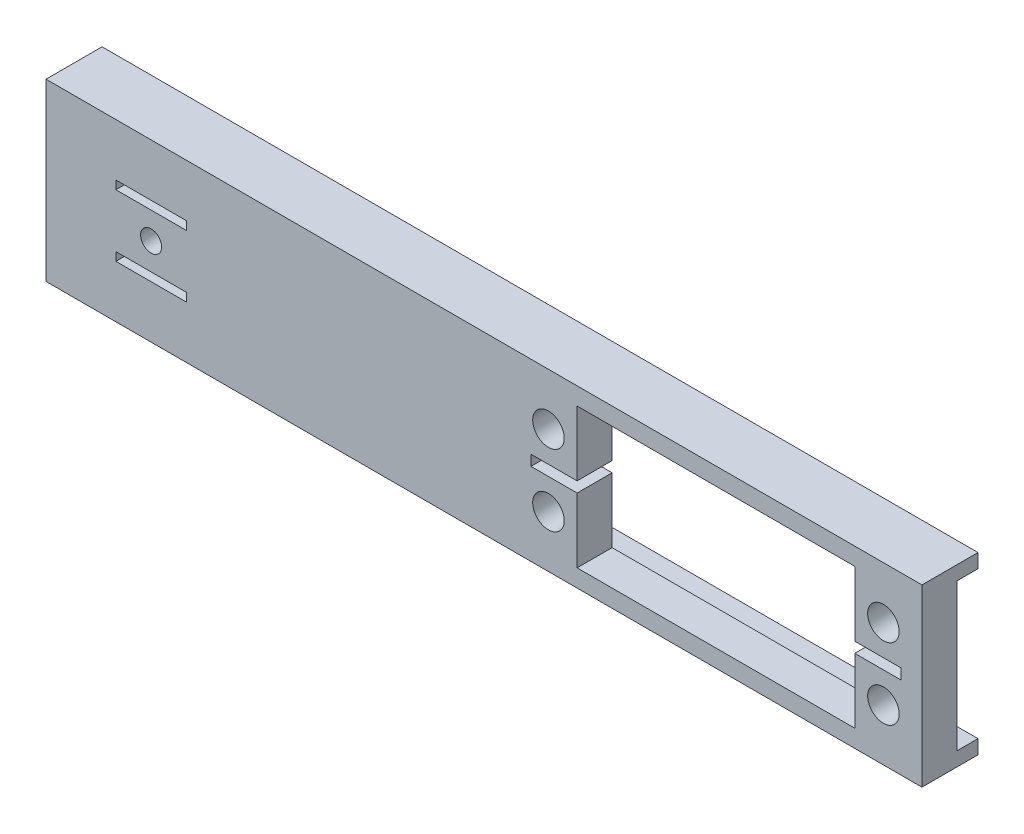
ISO-10303-21;
HEADER;
FILE_DESCRIPTION(('STEP AP214'),'2;1');
FILE_NAME('part.step','',(''),(''),'','','');
FILE_SCHEMA(('AUTOMOTIVE_DESIGN { 1 0 10303 214 1 1 1 1 }'));
ENDSEC;
DATA;
#1=APPLICATION_CONTEXT('core data for automotive mechanical design processes');
#2=APPLICATION_PROTOCOL_DEFINITION('international standard','automotive_design',2000,#1);
#3=PRODUCT_CONTEXT('',#1,'mechanical');
#4=PRODUCT('Part','Part','',(#3));
#5=PRODUCT_RELATED_PRODUCT_CATEGORY('part','',(#4));
#6=PRODUCT_DEFINITION_FORMATION('','',#4);
#7=PRODUCT_DEFINITION_CONTEXT('part definition',#1,'design');
#8=PRODUCT_DEFINITION('design','',#6,#7);
#9=PRODUCT_DEFINITION_SHAPE('','',#8);
#10=(LENGTH_UNIT() NAMED_UNIT(*) SI_UNIT(.MILLI.,.METRE.));
#11=(NAMED_UNIT(*) PLANE_ANGLE_UNIT() SI_UNIT($,.RADIAN.));
#12=(NAMED_UNIT(*) SI_UNIT($,.STERADIAN.) SOLID_ANGLE_UNIT());
#13=UNCERTAINTY_MEASURE_WITH_UNIT(LENGTH_MEASURE(1.E-05),#10,'distance_accuracy_value','');
#14=(GEOMETRIC_REPRESENTATION_CONTEXT(3) GLOBAL_UNCERTAINTY_ASSIGNED_CONTEXT((#13)) GLOBAL_UNIT_ASSIGNED_CONTEXT((#10,
#11,#12)) REPRESENTATION_CONTEXT('',''));
#15=CARTESIAN_POINT('',(0.,0.,0.));
#16=DIRECTION('',(0.,0.,1.));
#17=DIRECTION('',(1.,0.,0.));
#18=AXIS2_PLACEMENT_3D('',#15,#16,#17);
#19=CARTESIAN_POINT('',(0.,-5.0292,5.));
#20=DIRECTION('',(0.,-1.,0.));
#21=DIRECTION('',(1.,0.,0.));
#22=AXIS2_PLACEMENT_3D('',#19,#20,#21);
#23=PLANE('',#22);
#24=DIRECTION('',(-1.,0.,0.));
#25=VECTOR('',#24,1.);
#26=CARTESIAN_POINT('',(0.,-5.0292,0.));
#27=LINE('',#26,#25);
#28=CARTESIAN_POINT('',(-42.4708,-5.0292,0.));
#29=VERTEX_POINT('',#28);
#30=CARTESIAN_POINT('',(-52.5292,-5.0292,0.));
#31=VERTEX_POINT('',#30);
#32=EDGE_CURVE('E401',#29,#31,#27,.T.);
#33=ORIENTED_EDGE('',*,*,#32,.T.);
#34=DIRECTION('',(0.,0.,-1.));
#35=VECTOR('',#34,1.);
#36=CARTESIAN_POINT('',(-52.5292,-5.0292,5.));
#37=LINE('',#36,#35);
#38=CARTESIAN_POINT('',(-52.5292,-5.0292,5.));
#39=VERTEX_POINT('',#38);
#40=EDGE_CURVE('E429',#39,#31,#37,.T.);
#41=ORIENTED_EDGE('',*,*,#40,.F.);
#42=DIRECTION('',(-1.,0.,0.));
#43=VECTOR('',#42,1.);
#44=CARTESIAN_POINT('',(0.,-5.0292,5.));
#45=LINE('',#44,#43);
#46=CARTESIAN_POINT('',(-42.4708,-5.0292,5.));
#47=VERTEX_POINT('',#46);
#48=EDGE_CURVE('E329',#47,#39,#45,.T.);
#49=ORIENTED_EDGE('',*,*,#48,.F.);
#50=DIRECTION('',(0.,0.,-1.));
#51=VECTOR('',#50,1.);
#52=CARTESIAN_POINT('',(-42.4708,-5.0292,5.));
#53=LINE('',#52,#51);
#54=EDGE_CURVE('E421',#47,#29,#53,.T.);
#55=ORIENTED_EDGE('',*,*,#54,.T.);
#56=EDGE_LOOP('',(#33,#41,#49,#55));
#57=FACE_BOUND('',#56,.T.);
#58=ADVANCED_FACE('F45',(#57),#23,.F.);
#59=CARTESIAN_POINT('',(-52.5292,0.,5.));
#60=DIRECTION('',(-1.,0.,0.));
#61=DIRECTION('',(0.,0.,1.));
#62=AXIS2_PLACEMENT_3D('',#59,#60,#61);
#63=PLANE('',#62);
#64=DIRECTION('',(0.,1.,0.));
#65=VECTOR('',#64,1.);
#66=CARTESIAN_POINT('',(-52.5292,0.,0.));
#67=LINE('',#66,#65);
#68=CARTESIAN_POINT('',(-52.5292,-3.8227,0.));
#69=VERTEX_POINT('',#68);
#70=EDGE_CURVE('E356',#31,#69,#67,.T.);
#71=ORIENTED_EDGE('',*,*,#70,.T.);
#72=DIRECTION('',(0.,0.,-1.));
#73=VECTOR('',#72,1.);
#74=CARTESIAN_POINT('',(-52.5292,-3.8227,5.));
#75=LINE('',#74,#73);
#76=CARTESIAN_POINT('',(-52.5292,-3.8227,5.));
#77=VERTEX_POINT('',#76);
#78=EDGE_CURVE('E426',#77,#69,#75,.T.);
#79=ORIENTED_EDGE('',*,*,#78,.F.);
#80=DIRECTION('',(0.,1.,0.));
#81=VECTOR('',#80,1.);
#82=CARTESIAN_POINT('',(-52.5292,0.,5.));
#83=LINE('',#82,#81);
#84=EDGE_CURVE('E279',#39,#77,#83,.T.);
#85=ORIENTED_EDGE('',*,*,#84,.F.);
#86=ORIENTED_EDGE('',*,*,#40,.T.);
#87=EDGE_LOOP('',(#71,#79,#85,#86));
#88=FACE_BOUND('',#87,.T.);
#89=ADVANCED_FACE('F507',(#88),#63,.F.);
#90=CARTESIAN_POINT('',(0.,-3.8227,5.));
#91=DIRECTION('',(0.,1.,0.));
#92=DIRECTION('',(0.,0.,1.));
#93=AXIS2_PLACEMENT_3D('',#90,#91,#92);
#94=PLANE('',#93);
#95=DIRECTION('',(1.,0.,0.));
#96=VECTOR('',#95,1.);
#97=CARTESIAN_POINT('',(0.,-3.8227,0.));
#98=LINE('',#97,#96);
#99=CARTESIAN_POINT('',(-42.4708,-3.8227,0.));
#100=VERTEX_POINT('',#99);
#101=EDGE_CURVE('E404',#69,#100,#98,.T.);
#102=ORIENTED_EDGE('',*,*,#101,.T.);
#103=DIRECTION('',(0.,0.,-1.));
#104=VECTOR('',#103,1.);
#105=CARTESIAN_POINT('',(-42.4708,-3.8227,5.));
#106=LINE('',#105,#104);
#107=CARTESIAN_POINT('',(-42.4708,-3.8227,5.));
#108=VERTEX_POINT('',#107);
#109=EDGE_CURVE('E423',#108,#100,#106,.T.);
#110=ORIENTED_EDGE('',*,*,#109,.F.);
#111=DIRECTION('',(1.,0.,0.));
#112=VECTOR('',#111,1.);
#113=CARTESIAN_POINT('',(0.,-3.8227,5.));
#114=LINE('',#113,#112);
#115=EDGE_CURVE('E332',#77,#108,#114,.T.);
#116=ORIENTED_EDGE('',*,*,#115,.F.);
#117=ORIENTED_EDGE('',*,*,#78,.T.);
#118=EDGE_LOOP('',(#102,#110,#116,#117));
#119=FACE_BOUND('',#118,.T.);
#120=ADVANCED_FACE('F499',(#119),#94,.F.);
#121=CARTESIAN_POINT('',(0.,-12.5,5.));
#122=DIRECTION('',(0.,1.,0.));
#123=DIRECTION('',(0.,0.,1.));
#124=AXIS2_PLACEMENT_3D('',#121,#122,#123);
#125=PLANE('',#124);
#126=DIRECTION('',(0.,0.,-1.));
#127=VECTOR('',#126,1.);
#128=CARTESIAN_POINT('',(-62.5,-12.5,5.));
#129=LINE('',#128,#127);
#130=CARTESIAN_POINT('',(-62.5,-12.5,5.));
#131=VERTEX_POINT('',#130);
#132=CARTESIAN_POINT('',(-62.5,-12.5,-3.));
#133=VERTEX_POINT('',#132);
#134=EDGE_CURVE('E432',#131,#133,#129,.T.);
#135=ORIENTED_EDGE('',*,*,#134,.T.);
#136=DIRECTION('',(-1.,0.,0.));
#137=VECTOR('',#136,1.);
#138=CARTESIAN_POINT('',(0.,-12.5,-3.));
#139=LINE('',#138,#137);
#140=CARTESIAN_POINT('',(62.5,-12.5,-3.));
#141=VERTEX_POINT('',#140);
#142=EDGE_CURVE('E246',#141,#133,#139,.T.);
#143=ORIENTED_EDGE('',*,*,#142,.F.);
#144=DIRECTION('',(0.,0.,-1.));
#145=VECTOR('',#144,1.);
#146=CARTESIAN_POINT('',(62.5,-12.5,5.));
#147=LINE('',#146,#145);
#148=CARTESIAN_POINT('',(62.5,-12.5,5.));
#149=VERTEX_POINT('',#148);
#150=EDGE_CURVE('E424',#149,#141,#147,.T.);
#151=ORIENTED_EDGE('',*,*,#150,.F.);
#152=DIRECTION('',(1.,0.,0.));
#153=VECTOR('',#152,1.);
#154=CARTESIAN_POINT('',(0.,-12.5,5.));
#155=LINE('',#154,#153);
#156=EDGE_CURVE('E319',#131,#149,#155,.T.);
#157=ORIENTED_EDGE('',*,*,#156,.F.);
#158=EDGE_LOOP('',(#135,#143,#151,#157));
#159=FACE_BOUND('',#158,.T.);
#160=ADVANCED_FACE('F496',(#159),#125,.F.);
#161=CARTESIAN_POINT('',(62.5,0.,5.));
#162=DIRECTION('',(-1.,0.,0.));
#163=DIRECTION('',(0.,0.,1.));
#164=AXIS2_PLACEMENT_3D('',#161,#162,#163);
#165=PLANE('',#164);
#166=DIRECTION('',(0.,0.,-1.));
#167=VECTOR('',#166,1.);
#168=CARTESIAN_POINT('',(62.5,12.5,5.));
#169=LINE('',#168,#167);
#170=CARTESIAN_POINT('',(62.5,12.5,5.));
#171=VERTEX_POINT('',#170);
#172=CARTESIAN_POINT('',(62.5,12.5,-3.));
#173=VERTEX_POINT('',#172);
#174=EDGE_CURVE('E437',#171,#173,#169,.T.);
#175=ORIENTED_EDGE('',*,*,#174,.F.);
#176=DIRECTION('',(0.,1.,0.));
#177=VECTOR('',#176,1.);
#178=CARTESIAN_POINT('',(62.5,0.,5.));
#179=LINE('',#178,#177);
#180=EDGE_CURVE('E322',#149,#171,#179,.T.);
#181=ORIENTED_EDGE('',*,*,#180,.F.);
#182=ORIENTED_EDGE('',*,*,#150,.T.);
#183=DIRECTION('',(0.,-1.,0.));
#184=VECTOR('',#183,1.);
#185=CARTESIAN_POINT('',(62.5,-10.5,-3.));
#186=LINE('',#185,#184);
#187=CARTESIAN_POINT('',(62.5,-10.5,-3.));
#188=VERTEX_POINT('',#187);
#189=EDGE_CURVE('E251',#188,#141,#186,.T.);
#190=ORIENTED_EDGE('',*,*,#189,.F.);
#191=DIRECTION('',(0.,0.,-1.));
#192=VECTOR('',#191,1.);
#193=CARTESIAN_POINT('',(62.5,-10.5,5.));
#194=LINE('',#193,#192);
#195=CARTESIAN_POINT('',(62.5,-10.5,0.));
#196=VERTEX_POINT('',#195);
#197=EDGE_CURVE('E238',#196,#188,#194,.T.);
#198=ORIENTED_EDGE('',*,*,#197,.F.);
#199=DIRECTION('',(0.,1.,0.));
#200=VECTOR('',#199,1.);
#201=CARTESIAN_POINT('',(62.5,0.,0.));
#202=LINE('',#201,#200);
#203=CARTESIAN_POINT('',(62.5,10.5,0.));
#204=VERTEX_POINT('',#203);
#205=EDGE_CURVE('E60',#196,#204,#202,.T.);
#206=ORIENTED_EDGE('',*,*,#205,.T.);
#207=DIRECTION('',(0.,0.,-1.));
#208=VECTOR('',#207,1.);
#209=CARTESIAN_POINT('',(62.5,10.5,5.));
#210=LINE('',#209,#208);
#211=CARTESIAN_POINT('',(62.5,10.5,-3.));
#212=VERTEX_POINT('',#211);
#213=EDGE_CURVE('E260',#204,#212,#210,.T.);
#214=ORIENTED_EDGE('',*,*,#213,.T.);
#215=DIRECTION('',(0.,1.,0.));
#216=VECTOR('',#215,1.);
#217=CARTESIAN_POINT('',(62.5,10.5,-3.));
#218=LINE('',#217,#216);
#219=EDGE_CURVE('E264',#212,#173,#218,.T.);
#220=ORIENTED_EDGE('',*,*,#219,.T.);
#221=EDGE_LOOP('',(#175,#181,#182,#190,#198,#206,#214,#220));
#222=FACE_BOUND('',#221,.T.);
#223=ADVANCED_FACE('F481',(#222),#165,.F.);
#224=CARTESIAN_POINT('',(0.,12.5,5.));
#225=DIRECTION('',(0.,1.,0.));
#226=DIRECTION('',(0.,0.,1.));
#227=AXIS2_PLACEMENT_3D('',#224,#225,#226);
#228=PLANE('',#227);
#229=ORIENTED_EDGE('',*,*,#174,.T.);
#230=DIRECTION('',(-1.,0.,0.));
#231=VECTOR('',#230,1.);
#232=CARTESIAN_POINT('',(-62.5,12.5,-3.));
#233=LINE('',#232,#231);
#234=CARTESIAN_POINT('',(-62.5,12.5,-3.));
#235=VERTEX_POINT('',#234);
#236=EDGE_CURVE('E250',#173,#235,#233,.T.);
#237=ORIENTED_EDGE('',*,*,#236,.T.);
#238=DIRECTION('',(0.,0.,-1.));
#239=VECTOR('',#238,1.);
#240=CARTESIAN_POINT('',(-62.5,12.5,5.));
#241=LINE('',#240,#239);
#242=CARTESIAN_POINT('',(-62.5,12.5,5.));
#243=VERTEX_POINT('',#242);
#244=EDGE_CURVE('E434',#243,#235,#241,.T.);
#245=ORIENTED_EDGE('',*,*,#244,.F.);
#246=DIRECTION('',(1.,0.,0.));
#247=VECTOR('',#246,1.);
#248=CARTESIAN_POINT('',(0.,12.5,5.));
#249=LINE('',#248,#247);
#250=EDGE_CURVE('E324',#243,#171,#249,.T.);
#251=ORIENTED_EDGE('',*,*,#250,.T.);
#252=EDGE_LOOP('',(#229,#237,#245,#251));
#253=FACE_BOUND('',#252,.T.);
#254=ADVANCED_FACE('F487',(#253),#228,.T.);
#255=CARTESIAN_POINT('',(52.912,0.,5.));
#256=DIRECTION('',(-1.,0.,0.));
#257=DIRECTION('',(0.,0.,1.));
#258=AXIS2_PLACEMENT_3D('',#255,#256,#257);
#259=PLANE('',#258);
#260=DIRECTION('',(0.,1.,0.));
#261=VECTOR('',#260,1.);
#262=CARTESIAN_POINT('',(52.912,0.,0.));
#263=LINE('',#262,#261);
#264=CARTESIAN_POINT('',(52.912,-10.,0.));
#265=VERTEX_POINT('',#264);
#266=CARTESIAN_POINT('',(52.912,-0.750000000000005,0.));
#267=VERTEX_POINT('',#266);
#268=EDGE_CURVE('E362',#265,#267,#263,.T.);
#269=ORIENTED_EDGE('',*,*,#268,.F.);
#270=DIRECTION('',(0.,0.,-1.));
#271=VECTOR('',#270,1.);
#272=CARTESIAN_POINT('',(52.912,-10.,5.));
#273=LINE('',#272,#271);
#274=CARTESIAN_POINT('',(52.912,-10.,5.));
#275=VERTEX_POINT('',#274);
#276=EDGE_CURVE('E435',#275,#265,#273,.T.);
#277=ORIENTED_EDGE('',*,*,#276,.F.);
#278=DIRECTION('',(0.,1.,0.));
#279=VECTOR('',#278,1.);
#280=CARTESIAN_POINT('',(52.912,0.,5.));
#281=LINE('',#280,#279);
#282=CARTESIAN_POINT('',(52.912,-0.750000000000005,5.));
#283=VERTEX_POINT('',#282);
#284=EDGE_CURVE('E285',#275,#283,#281,.T.);
#285=ORIENTED_EDGE('',*,*,#284,.T.);
#286=DIRECTION('',(0.,0.,-1.));
#287=VECTOR('',#286,1.);
#288=CARTESIAN_POINT('',(52.912,-0.750000000000005,5.));
#289=LINE('',#288,#287);
#290=EDGE_CURVE('E440',#283,#267,#289,.T.);
#291=ORIENTED_EDGE('',*,*,#290,.T.);
#292=EDGE_LOOP('',(#269,#277,#285,#291));
#293=FACE_BOUND('',#292,.T.);
#294=ADVANCED_FACE('F526',(#293),#259,.T.);
#295=CARTESIAN_POINT('',(0.,-10.,5.));
#296=DIRECTION('',(0.,-1.,0.));
#297=DIRECTION('',(1.,0.,0.));
#298=AXIS2_PLACEMENT_3D('',#295,#296,#297);
#299=PLANE('',#298);
#300=DIRECTION('',(-1.,0.,0.));
#301=VECTOR('',#300,1.);
#302=CARTESIAN_POINT('',(0.,-10.,0.));
#303=LINE('',#302,#301);
#304=CARTESIAN_POINT('',(13.288,-10.,0.));
#305=VERTEX_POINT('',#304);
#306=EDGE_CURVE('E366',#265,#305,#303,.T.);
#307=ORIENTED_EDGE('',*,*,#306,.T.);
#308=DIRECTION('',(0.,0.,-1.));
#309=VECTOR('',#308,1.);
#310=CARTESIAN_POINT('',(13.288,-10.,5.));
#311=LINE('',#310,#309);
#312=CARTESIAN_POINT('',(13.288,-10.,5.));
#313=VERTEX_POINT('',#312);
#314=EDGE_CURVE('E463',#313,#305,#311,.T.);
#315=ORIENTED_EDGE('',*,*,#314,.F.);
#316=DIRECTION('',(-1.,0.,0.));
#317=VECTOR('',#316,1.);
#318=CARTESIAN_POINT('',(0.,-10.,5.));
#319=LINE('',#318,#317);
#320=EDGE_CURVE('E289',#275,#313,#319,.T.);
#321=ORIENTED_EDGE('',*,*,#320,.F.);
#322=ORIENTED_EDGE('',*,*,#276,.T.);
#323=EDGE_LOOP('',(#307,#315,#321,#322));
#324=FACE_BOUND('',#323,.T.);
#325=ADVANCED_FACE('F532',(#324),#299,.F.);
#326=CARTESIAN_POINT('',(13.288,0.,5.));
#327=DIRECTION('',(-1.,0.,0.));
#328=DIRECTION('',(0.,0.,1.));
#329=AXIS2_PLACEMENT_3D('',#326,#327,#328);
#330=PLANE('',#329);
#331=DIRECTION('',(0.,1.,0.));
#332=VECTOR('',#331,1.);
#333=CARTESIAN_POINT('',(13.288,0.,0.));
#334=LINE('',#333,#332);
#335=CARTESIAN_POINT('',(13.288,-0.749999999999995,0.));
#336=VERTEX_POINT('',#335);
#337=EDGE_CURVE('E369',#305,#336,#334,.T.);
#338=ORIENTED_EDGE('',*,*,#337,.T.);
#339=DIRECTION('',(0.,0.,-1.));
#340=VECTOR('',#339,1.);
#341=CARTESIAN_POINT('',(13.288,-0.749999999999995,5.));
#342=LINE('',#341,#340);
#343=CARTESIAN_POINT('',(13.288,-0.749999999999995,5.));
#344=VERTEX_POINT('',#343);
#345=EDGE_CURVE('E460',#344,#336,#342,.T.);
#346=ORIENTED_EDGE('',*,*,#345,.F.);
#347=DIRECTION('',(0.,1.,0.));
#348=VECTOR('',#347,1.);
#349=CARTESIAN_POINT('',(13.288,0.,5.));
#350=LINE('',#349,#348);
#351=EDGE_CURVE('E292',#313,#344,#350,.T.);
#352=ORIENTED_EDGE('',*,*,#351,.F.);
#353=ORIENTED_EDGE('',*,*,#314,.T.);
#354=EDGE_LOOP('',(#338,#346,#352,#353));
#355=FACE_BOUND('',#354,.T.);
#356=ADVANCED_FACE('F538',(#355),#330,.F.);
#357=CARTESIAN_POINT('',(0.,-0.749999999999994,5.));
#358=DIRECTION('',(0.,-1.,0.));
#359=DIRECTION('',(1.,0.,0.));
#360=AXIS2_PLACEMENT_3D('',#357,#358,#359);
#361=PLANE('',#360);
#362=DIRECTION('',(-1.,0.,0.));
#363=VECTOR('',#362,1.);
#364=CARTESIAN_POINT('',(0.,-0.749999999999994,0.));
#365=LINE('',#364,#363);
#366=CARTESIAN_POINT('',(6.7,-0.749999999999995,0.));
#367=VERTEX_POINT('',#366);
#368=EDGE_CURVE('E372',#336,#367,#365,.T.);
#369=ORIENTED_EDGE('',*,*,#368,.T.);
#370=DIRECTION('',(0.,0.,-1.));
#371=VECTOR('',#370,1.);
#372=CARTESIAN_POINT('',(6.7,-0.749999999999995,5.));
#373=LINE('',#372,#371);
#374=CARTESIAN_POINT('',(6.7,-0.749999999999995,5.));
#375=VERTEX_POINT('',#374);
#376=EDGE_CURVE('E457',#375,#367,#373,.T.);
#377=ORIENTED_EDGE('',*,*,#376,.F.);
#378=DIRECTION('',(-1.,0.,0.));
#379=VECTOR('',#378,1.);
#380=CARTESIAN_POINT('',(0.,-0.749999999999994,5.));
#381=LINE('',#380,#379);
#382=EDGE_CURVE('E295',#344,#375,#381,.T.);
#383=ORIENTED_EDGE('',*,*,#382,.F.);
#384=ORIENTED_EDGE('',*,*,#345,.T.);
#385=EDGE_LOOP('',(#369,#377,#383,#384));
#386=FACE_BOUND('',#385,.T.);
#387=ADVANCED_FACE('F604',(#386),#361,.F.);
#388=CARTESIAN_POINT('',(6.7,0.,5.));
#389=DIRECTION('',(-1.,0.,0.));
#390=DIRECTION('',(0.,0.,1.));
#391=AXIS2_PLACEMENT_3D('',#388,#389,#390);
#392=PLANE('',#391);
#393=DIRECTION('',(0.,1.,0.));
#394=VECTOR('',#393,1.);
#395=CARTESIAN_POINT('',(6.7,0.,0.));
#396=LINE('',#395,#394);
#397=CARTESIAN_POINT('',(6.7,0.749999999999995,0.));
#398=VERTEX_POINT('',#397);
#399=EDGE_CURVE('E375',#367,#398,#396,.T.);
#400=ORIENTED_EDGE('',*,*,#399,.T.);
#401=DIRECTION('',(0.,0.,-1.));
#402=VECTOR('',#401,1.);
#403=CARTESIAN_POINT('',(6.7,0.749999999999995,5.));
#404=LINE('',#403,#402);
#405=CARTESIAN_POINT('',(6.7,0.749999999999995,5.));
#406=VERTEX_POINT('',#405);
#407=EDGE_CURVE('E455',#406,#398,#404,.T.);
#408=ORIENTED_EDGE('',*,*,#407,.F.);
#409=DIRECTION('',(0.,1.,0.));
#410=VECTOR('',#409,1.);
#411=CARTESIAN_POINT('',(6.7,0.,5.));
#412=LINE('',#411,#410);
#413=EDGE_CURVE('E298',#375,#406,#412,.T.);
#414=ORIENTED_EDGE('',*,*,#413,.F.);
#415=ORIENTED_EDGE('',*,*,#376,.T.);
#416=EDGE_LOOP('',(#400,#408,#414,#415));
#417=FACE_BOUND('',#416,.T.);
#418=ADVANCED_FACE('F600',(#417),#392,.F.);
#419=CARTESIAN_POINT('',(0.,0.749999999999994,5.));
#420=DIRECTION('',(0.,-1.,0.));
#421=DIRECTION('',(1.,0.,0.));
#422=AXIS2_PLACEMENT_3D('',#419,#420,#421);
#423=PLANE('',#422);
#424=DIRECTION('',(-1.,0.,0.));
#425=VECTOR('',#424,1.);
#426=CARTESIAN_POINT('',(0.,0.749999999999994,0.));
#427=LINE('',#426,#425);
#428=CARTESIAN_POINT('',(13.288,0.749999999999995,0.));
#429=VERTEX_POINT('',#428);
#430=EDGE_CURVE('E378',#429,#398,#427,.T.);
#431=ORIENTED_EDGE('',*,*,#430,.F.);
#432=DIRECTION('',(0.,0.,-1.));
#433=VECTOR('',#432,1.);
#434=CARTESIAN_POINT('',(13.288,0.749999999999995,5.));
#435=LINE('',#434,#433);
#436=CARTESIAN_POINT('',(13.288,0.749999999999995,5.));
#437=VERTEX_POINT('',#436);
#438=EDGE_CURVE('E453',#437,#429,#435,.T.);
#439=ORIENTED_EDGE('',*,*,#438,.F.);
#440=DIRECTION('',(-1.,0.,0.));
#441=VECTOR('',#440,1.);
#442=CARTESIAN_POINT('',(0.,0.749999999999994,5.));
#443=LINE('',#442,#441);
#444=EDGE_CURVE('E300',#437,#406,#443,.T.);
#445=ORIENTED_EDGE('',*,*,#444,.T.);
#446=ORIENTED_EDGE('',*,*,#407,.T.);
#447=EDGE_LOOP('',(#431,#439,#445,#446));
#448=FACE_BOUND('',#447,.T.);
#449=ADVANCED_FACE('F596',(#448),#423,.T.);
#450=CARTESIAN_POINT('',(13.288,0.,5.));
#451=DIRECTION('',(-1.,0.,0.));
#452=DIRECTION('',(0.,0.,1.));
#453=AXIS2_PLACEMENT_3D('',#450,#451,#452);
#454=PLANE('',#453);
#455=DIRECTION('',(0.,1.,0.));
#456=VECTOR('',#455,1.);
#457=CARTESIAN_POINT('',(13.288,0.,0.));
#458=LINE('',#457,#456);
#459=CARTESIAN_POINT('',(13.288,9.99999999999999,0.));
#460=VERTEX_POINT('',#459);
#461=EDGE_CURVE('E381',#429,#460,#458,.T.);
#462=ORIENTED_EDGE('',*,*,#461,.T.);
#463=DIRECTION('',(0.,0.,-1.));
#464=VECTOR('',#463,1.);
#465=CARTESIAN_POINT('',(13.288,9.99999999999999,5.));
#466=LINE('',#465,#464);
#467=CARTESIAN_POINT('',(13.288,9.99999999999999,5.));
#468=VERTEX_POINT('',#467);
#469=EDGE_CURVE('E451',#468,#460,#466,.T.);
#470=ORIENTED_EDGE('',*,*,#469,.F.);
#471=DIRECTION('',(0.,1.,0.));
#472=VECTOR('',#471,1.);
#473=CARTESIAN_POINT('',(13.288,0.,5.));
#474=LINE('',#473,#472);
#475=EDGE_CURVE('E303',#437,#468,#474,.T.);
#476=ORIENTED_EDGE('',*,*,#475,.F.);
#477=ORIENTED_EDGE('',*,*,#438,.T.);
#478=EDGE_LOOP('',(#462,#470,#476,#477));
#479=FACE_BOUND('',#478,.T.);
#480=ADVANCED_FACE('F592',(#479),#454,.F.);
#481=CARTESIAN_POINT('',(0.,9.99999999999999,5.));
#482=DIRECTION('',(0.,-1.,0.));
#483=DIRECTION('',(1.,0.,0.));
#484=AXIS2_PLACEMENT_3D('',#481,#482,#483);
#485=PLANE('',#484);
#486=DIRECTION('',(-1.,0.,0.));
#487=VECTOR('',#486,1.);
#488=CARTESIAN_POINT('',(0.,9.99999999999999,0.));
#489=LINE('',#488,#487);
#490=CARTESIAN_POINT('',(52.912,10.,0.));
#491=VERTEX_POINT('',#490);
#492=EDGE_CURVE('E384',#491,#460,#489,.T.);
#493=ORIENTED_EDGE('',*,*,#492,.F.);
#494=DIRECTION('',(0.,0.,-1.));
#495=VECTOR('',#494,1.);
#496=CARTESIAN_POINT('',(52.912,10.,5.));
#497=LINE('',#496,#495);
#498=CARTESIAN_POINT('',(52.912,10.,5.));
#499=VERTEX_POINT('',#498);
#500=EDGE_CURVE('E449',#499,#491,#497,.T.);
#501=ORIENTED_EDGE('',*,*,#500,.F.);
#502=DIRECTION('',(-1.,0.,0.));
#503=VECTOR('',#502,1.);
#504=CARTESIAN_POINT('',(0.,9.99999999999999,5.));
#505=LINE('',#504,#503);
#506=EDGE_CURVE('E305',#499,#468,#505,.T.);
#507=ORIENTED_EDGE('',*,*,#506,.T.);
#508=ORIENTED_EDGE('',*,*,#469,.T.);
#509=EDGE_LOOP('',(#493,#501,#507,#508));
#510=FACE_BOUND('',#509,.T.);
#511=ADVANCED_FACE('F588',(#510),#485,.T.);
#512=CARTESIAN_POINT('',(52.912,0.,5.));
#513=DIRECTION('',(-1.,0.,0.));
#514=DIRECTION('',(0.,0.,1.));
#515=AXIS2_PLACEMENT_3D('',#512,#513,#514);
#516=PLANE('',#515);
#517=DIRECTION('',(0.,1.,0.));
#518=VECTOR('',#517,1.);
#519=CARTESIAN_POINT('',(52.912,0.,0.));
#520=LINE('',#519,#518);
#521=CARTESIAN_POINT('',(52.912,0.750000000000005,0.));
#522=VERTEX_POINT('',#521);
#523=EDGE_CURVE('E387',#522,#491,#520,.T.);
#524=ORIENTED_EDGE('',*,*,#523,.F.);
#525=DIRECTION('',(0.,0.,-1.));
#526=VECTOR('',#525,1.);
#527=CARTESIAN_POINT('',(52.912,0.750000000000005,5.));
#528=LINE('',#527,#526);
#529=CARTESIAN_POINT('',(52.912,0.750000000000005,5.));
#530=VERTEX_POINT('',#529);
#531=EDGE_CURVE('E447',#530,#522,#528,.T.);
#532=ORIENTED_EDGE('',*,*,#531,.F.);
#533=DIRECTION('',(0.,1.,0.));
#534=VECTOR('',#533,1.);
#535=CARTESIAN_POINT('',(52.912,0.,5.));
#536=LINE('',#535,#534);
#537=EDGE_CURVE('E308',#530,#499,#536,.T.);
#538=ORIENTED_EDGE('',*,*,#537,.T.);
#539=ORIENTED_EDGE('',*,*,#500,.T.);
#540=EDGE_LOOP('',(#524,#532,#538,#539));
#541=FACE_BOUND('',#540,.T.);
#542=ADVANCED_FACE('F581',(#541),#516,.T.);
#543=CARTESIAN_POINT('',(0.,0.750000000000005,5.));
#544=DIRECTION('',(0.,1.,0.));
#545=DIRECTION('',(0.,0.,1.));
#546=AXIS2_PLACEMENT_3D('',#543,#544,#545);
#547=PLANE('',#546);
#548=DIRECTION('',(1.,0.,0.));
#549=VECTOR('',#548,1.);
#550=CARTESIAN_POINT('',(0.,0.750000000000005,0.));
#551=LINE('',#550,#549);
#552=CARTESIAN_POINT('',(59.5,0.750000000000005,0.));
#553=VERTEX_POINT('',#552);
#554=EDGE_CURVE('E390',#522,#553,#551,.T.);
#555=ORIENTED_EDGE('',*,*,#554,.T.);
#556=DIRECTION('',(0.,0.,-1.));
#557=VECTOR('',#556,1.);
#558=CARTESIAN_POINT('',(59.5,0.750000000000005,5.));
#559=LINE('',#558,#557);
#560=CARTESIAN_POINT('',(59.5,0.750000000000005,5.));
#561=VERTEX_POINT('',#560);
#562=EDGE_CURVE('E445',#561,#553,#559,.T.);
#563=ORIENTED_EDGE('',*,*,#562,.F.);
#564=DIRECTION('',(1.,0.,0.));
#565=VECTOR('',#564,1.);
#566=CARTESIAN_POINT('',(0.,0.750000000000005,5.));
#567=LINE('',#566,#565);
#568=EDGE_CURVE('E311',#530,#561,#567,.T.);
#569=ORIENTED_EDGE('',*,*,#568,.F.);
#570=ORIENTED_EDGE('',*,*,#531,.T.);
#571=EDGE_LOOP('',(#555,#563,#569,#570));
#572=FACE_BOUND('',#571,.T.);
#573=ADVANCED_FACE('F575',(#572),#547,.F.);
#574=CARTESIAN_POINT('',(59.5,0.,5.));
#575=DIRECTION('',(-1.,0.,0.));
#576=DIRECTION('',(0.,0.,1.));
#577=AXIS2_PLACEMENT_3D('',#574,#575,#576);
#578=PLANE('',#577);
#579=DIRECTION('',(0.,1.,0.));
#580=VECTOR('',#579,1.);
#581=CARTESIAN_POINT('',(59.5,0.,0.));
#582=LINE('',#581,#580);
#583=CARTESIAN_POINT('',(59.5,-0.750000000000005,0.));
#584=VERTEX_POINT('',#583);
#585=EDGE_CURVE('E393',#584,#553,#582,.T.);
#586=ORIENTED_EDGE('',*,*,#585,.F.);
#587=DIRECTION('',(0.,0.,-1.));
#588=VECTOR('',#587,1.);
#589=CARTESIAN_POINT('',(59.5,-0.750000000000005,5.));
#590=LINE('',#589,#588);
#591=CARTESIAN_POINT('',(59.5,-0.750000000000005,5.));
#592=VERTEX_POINT('',#591);
#593=EDGE_CURVE('E442',#592,#584,#590,.T.);
#594=ORIENTED_EDGE('',*,*,#593,.F.);
#595=DIRECTION('',(0.,1.,0.));
#596=VECTOR('',#595,1.);
#597=CARTESIAN_POINT('',(59.5,0.,5.));
#598=LINE('',#597,#596);
#599=EDGE_CURVE('E313',#592,#561,#598,.T.);
#600=ORIENTED_EDGE('',*,*,#599,.T.);
#601=ORIENTED_EDGE('',*,*,#562,.T.);
#602=EDGE_LOOP('',(#586,#594,#600,#601));
#603=FACE_BOUND('',#602,.T.);
#604=ADVANCED_FACE('F571',(#603),#578,.T.);
#605=CARTESIAN_POINT('',(0.,3.8227,5.));
#606=DIRECTION('',(0.,1.,0.));
#607=DIRECTION('',(0.,0.,1.));
#608=AXIS2_PLACEMENT_3D('',#605,#606,#607);
#609=PLANE('',#608);
#610=DIRECTION('',(1.,0.,0.));
#611=VECTOR('',#610,1.);
#612=CARTESIAN_POINT('',(0.,3.8227,0.));
#613=LINE('',#612,#611);
#614=CARTESIAN_POINT('',(-52.5292,3.8227,0.));
#615=VERTEX_POINT('',#614);
#616=CARTESIAN_POINT('',(-42.4708,3.8227,0.));
#617=VERTEX_POINT('',#616);
#618=EDGE_CURVE('E269',#615,#617,#613,.T.);
#619=ORIENTED_EDGE('',*,*,#618,.F.);
#620=DIRECTION('',(0.,0.,-1.));
#621=VECTOR('',#620,1.);
#622=CARTESIAN_POINT('',(-52.5292,3.8227,5.));
#623=LINE('',#622,#621);
#624=CARTESIAN_POINT('',(-52.5292,3.8227,5.));
#625=VERTEX_POINT('',#624);
#626=EDGE_CURVE('E443',#625,#615,#623,.T.);
#627=ORIENTED_EDGE('',*,*,#626,.F.);
#628=DIRECTION('',(1.,0.,0.));
#629=VECTOR('',#628,1.);
#630=CARTESIAN_POINT('',(0.,3.8227,5.));
#631=LINE('',#630,#629);
#632=CARTESIAN_POINT('',(-42.4708,3.8227,5.));
#633=VERTEX_POINT('',#632);
#634=EDGE_CURVE('E272',#625,#633,#631,.T.);
#635=ORIENTED_EDGE('',*,*,#634,.T.);
#636=DIRECTION('',(0.,0.,-1.));
#637=VECTOR('',#636,1.);
#638=CARTESIAN_POINT('',(-42.4708,3.8227,5.));
#639=LINE('',#638,#637);
#640=EDGE_CURVE('E349',#633,#617,#639,.T.);
#641=ORIENTED_EDGE('',*,*,#640,.T.);
#642=EDGE_LOOP('',(#619,#627,#635,#641));
#643=FACE_BOUND('',#642,.T.);
#644=ADVANCED_FACE('F47',(#643),#609,.T.);
#645=CARTESIAN_POINT('',(-52.5292,5.0292,0.));
#646=VERTEX_POINT('',#645);
#647=EDGE_CURVE('E352',#615,#646,#67,.T.);
#648=ORIENTED_EDGE('',*,*,#647,.T.);
#649=DIRECTION('',(0.,0.,-1.));
#650=VECTOR('',#649,1.);
#651=CARTESIAN_POINT('',(-52.5292,5.0292,5.));
#652=LINE('',#651,#650);
#653=CARTESIAN_POINT('',(-52.5292,5.0292,5.));
#654=VERTEX_POINT('',#653);
#655=EDGE_CURVE('E470',#654,#646,#652,.T.);
#656=ORIENTED_EDGE('',*,*,#655,.F.);
#657=EDGE_CURVE('E275',#625,#654,#83,.T.);
#658=ORIENTED_EDGE('',*,*,#657,.F.);
#659=ORIENTED_EDGE('',*,*,#626,.T.);
#660=EDGE_LOOP('',(#648,#656,#658,#659));
#661=FACE_BOUND('',#660,.T.);
#662=ADVANCED_FACE('F519',(#661),#63,.F.);
#663=CARTESIAN_POINT('',(0.,5.0292,5.));
#664=DIRECTION('',(0.,-1.,0.));
#665=DIRECTION('',(0.,0.,-1.));
#666=AXIS2_PLACEMENT_3D('',#663,#664,#665);
#667=PLANE('',#666);
#668=DIRECTION('',(-1.,0.,0.));
#669=VECTOR('',#668,1.);
#670=CARTESIAN_POINT('',(0.,5.0292,0.));
#671=LINE('',#670,#669);
#672=CARTESIAN_POINT('',(-42.4708,5.0292,0.));
#673=VERTEX_POINT('',#672);
#674=EDGE_CURVE('E355',#673,#646,#671,.T.);
#675=ORIENTED_EDGE('',*,*,#674,.F.);
#676=DIRECTION('',(0.,0.,-1.));
#677=VECTOR('',#676,1.);
#678=CARTESIAN_POINT('',(-42.4708,5.0292,5.));
#679=LINE('',#678,#677);
#680=CARTESIAN_POINT('',(-42.4708,5.0292,5.));
#681=VERTEX_POINT('',#680);
#682=EDGE_CURVE('E468',#681,#673,#679,.T.);
#683=ORIENTED_EDGE('',*,*,#682,.F.);
#684=DIRECTION('',(-1.,0.,0.));
#685=VECTOR('',#684,1.);
#686=CARTESIAN_POINT('',(0.,5.0292,5.));
#687=LINE('',#686,#685);
#688=EDGE_CURVE('E278',#681,#654,#687,.T.);
#689=ORIENTED_EDGE('',*,*,#688,.T.);
#690=ORIENTED_EDGE('',*,*,#655,.T.);
#691=EDGE_LOOP('',(#675,#683,#689,#690));
#692=FACE_BOUND('',#691,.T.);
#693=ADVANCED_FACE('F543',(#692),#667,.T.);
#694=CARTESIAN_POINT('',(9.2,-5.1,5.));
#695=DIRECTION('',(0.,0.,-1.));
#696=DIRECTION('',(-1.,0.,0.));
#697=AXIS2_PLACEMENT_3D('',#694,#695,#696);
#698=CYLINDRICAL_SURFACE('',#697,2.25);
#699=CARTESIAN_POINT('',(9.2,-5.1,5.));
#700=DIRECTION('',(0.,0.,1.));
#701=DIRECTION('',(1.,0.,0.));
#702=AXIS2_PLACEMENT_3D('',#699,#700,#701);
#703=CIRCLE('',#702,2.25);
#704=CARTESIAN_POINT('',(11.45,-5.1,5.));
#705=VERTEX_POINT('',#704);
#706=EDGE_CURVE('E343',#705,#705,#703,.T.);
#707=ORIENTED_EDGE('',*,*,#706,.T.);
#708=EDGE_LOOP('',(#707));
#709=FACE_BOUND('',#708,.T.);
#710=CARTESIAN_POINT('',(9.2,-5.1,0.));
#711=DIRECTION('',(0.,0.,1.));
#712=DIRECTION('',(1.,0.,0.));
#713=AXIS2_PLACEMENT_3D('',#710,#711,#712);
#714=CIRCLE('',#713,2.25);
#715=CARTESIAN_POINT('',(11.45,-5.1,0.));
#716=VERTEX_POINT('',#715);
#717=EDGE_CURVE('E416',#716,#716,#714,.T.);
#718=ORIENTED_EDGE('',*,*,#717,.F.);
#719=EDGE_LOOP('',(#718));
#720=FACE_BOUND('',#719,.T.);
#721=ADVANCED_FACE('F545',(#709,#720),#698,.F.);
#722=CARTESIAN_POINT('',(9.2,5.1,5.));
#723=DIRECTION('',(0.,0.,-1.));
#724=DIRECTION('',(-1.,0.,0.));
#725=AXIS2_PLACEMENT_3D('',#722,#723,#724);
#726=CYLINDRICAL_SURFACE('',#725,2.25);
#727=CARTESIAN_POINT('',(9.2,5.1,5.));
#728=DIRECTION('',(0.,0.,1.));
#729=DIRECTION('',(1.,0.,0.));
#730=AXIS2_PLACEMENT_3D('',#727,#728,#729);
#731=CIRCLE('',#730,2.25);
#732=CARTESIAN_POINT('',(11.45,5.1,5.));
#733=VERTEX_POINT('',#732);
#734=EDGE_CURVE('E340',#733,#733,#731,.T.);
#735=ORIENTED_EDGE('',*,*,#734,.T.);
#736=EDGE_LOOP('',(#735));
#737=FACE_BOUND('',#736,.T.);
#738=CARTESIAN_POINT('',(9.2,5.1,0.));
#739=DIRECTION('',(0.,0.,1.));
#740=DIRECTION('',(1.,0.,0.));
#741=AXIS2_PLACEMENT_3D('',#738,#739,#740);
#742=CIRCLE('',#741,2.25);
#743=CARTESIAN_POINT('',(11.45,5.1,0.));
#744=VERTEX_POINT('',#743);
#745=EDGE_CURVE('E413',#744,#744,#742,.T.);
#746=ORIENTED_EDGE('',*,*,#745,.F.);
#747=EDGE_LOOP('',(#746));
#748=FACE_BOUND('',#747,.T.);
#749=ADVANCED_FACE('F551',(#737,#748),#726,.F.);
#750=CARTESIAN_POINT('',(57.,-5.1,5.));
#751=DIRECTION('',(0.,0.,-1.));
#752=DIRECTION('',(-1.,0.,0.));
#753=AXIS2_PLACEMENT_3D('',#750,#751,#752);
#754=CYLINDRICAL_SURFACE('',#753,2.24999999999998);
#755=CARTESIAN_POINT('',(57.,-5.1,5.));
#756=DIRECTION('',(0.,0.,1.));
#757=DIRECTION('',(1.,0.,0.));
#758=AXIS2_PLACEMENT_3D('',#755,#756,#757);
#759=CIRCLE('',#758,2.24999999999998);
#760=CARTESIAN_POINT('',(59.25,-5.1,5.));
#761=VERTEX_POINT('',#760);
#762=EDGE_CURVE('E337',#761,#761,#759,.T.);
#763=ORIENTED_EDGE('',*,*,#762,.T.);
#764=EDGE_LOOP('',(#763));
#765=FACE_BOUND('',#764,.T.);
#766=CARTESIAN_POINT('',(57.,-5.1,0.));
#767=DIRECTION('',(0.,0.,1.));
#768=DIRECTION('',(1.,0.,0.));
#769=AXIS2_PLACEMENT_3D('',#766,#767,#768);
#770=CIRCLE('',#769,2.24999999999998);
#771=CARTESIAN_POINT('',(59.25,-5.1,0.));
#772=VERTEX_POINT('',#771);
#773=EDGE_CURVE('E410',#772,#772,#770,.T.);
#774=ORIENTED_EDGE('',*,*,#773,.F.);
#775=EDGE_LOOP('',(#774));
#776=FACE_BOUND('',#775,.T.);
#777=ADVANCED_FACE('F653',(#765,#776),#754,.F.);
#778=CARTESIAN_POINT('',(57.,5.1,5.));
#779=DIRECTION('',(0.,0.,-1.));
#780=DIRECTION('',(-1.,0.,0.));
#781=AXIS2_PLACEMENT_3D('',#778,#779,#780);
#782=CYLINDRICAL_SURFACE('',#781,2.24999999999998);
#783=CARTESIAN_POINT('',(57.,5.1,5.));
#784=DIRECTION('',(0.,0.,1.));
#785=DIRECTION('',(1.,0.,0.));
#786=AXIS2_PLACEMENT_3D('',#783,#784,#785);
#787=CIRCLE('',#786,2.24999999999998);
#788=CARTESIAN_POINT('',(59.25,5.1,5.));
#789=VERTEX_POINT('',#788);
#790=EDGE_CURVE('E334',#789,#789,#787,.T.);
#791=ORIENTED_EDGE('',*,*,#790,.T.);
#792=EDGE_LOOP('',(#791));
#793=FACE_BOUND('',#792,.T.);
#794=CARTESIAN_POINT('',(57.,5.1,0.));
#795=DIRECTION('',(0.,0.,1.));
#796=DIRECTION('',(1.,0.,0.));
#797=AXIS2_PLACEMENT_3D('',#794,#795,#796);
#798=CIRCLE('',#797,2.24999999999998);
#799=CARTESIAN_POINT('',(59.25,5.1,0.));
#800=VERTEX_POINT('',#799);
#801=EDGE_CURVE('E407',#800,#800,#798,.T.);
#802=ORIENTED_EDGE('',*,*,#801,.F.);
#803=EDGE_LOOP('',(#802));
#804=FACE_BOUND('',#803,.T.);
#805=ADVANCED_FACE('F648',(#793,#804),#782,.F.);
#806=CARTESIAN_POINT('',(-42.4708,0.,5.));
#807=DIRECTION('',(-1.,0.,0.));
#808=DIRECTION('',(0.,0.,1.));
#809=AXIS2_PLACEMENT_3D('',#806,#807,#808);
#810=PLANE('',#809);
#811=DIRECTION('',(0.,1.,0.));
#812=VECTOR('',#811,1.);
#813=CARTESIAN_POINT('',(-42.4708,0.,0.));
#814=LINE('',#813,#812);
#815=EDGE_CURVE('E363',#29,#100,#814,.T.);
#816=ORIENTED_EDGE('',*,*,#815,.F.);
#817=ORIENTED_EDGE('',*,*,#54,.F.);
#818=DIRECTION('',(0.,1.,0.));
#819=VECTOR('',#818,1.);
#820=CARTESIAN_POINT('',(-42.4708,0.,5.));
#821=LINE('',#820,#819);
#822=EDGE_CURVE('E286',#47,#108,#821,.T.);
#823=ORIENTED_EDGE('',*,*,#822,.T.);
#824=ORIENTED_EDGE('',*,*,#109,.T.);
#825=EDGE_LOOP('',(#816,#817,#823,#824));
#826=FACE_BOUND('',#825,.T.);
#827=ADVANCED_FACE('F524',(#826),#810,.T.);
#828=CARTESIAN_POINT('',(-62.5,0.,5.));
#829=DIRECTION('',(-1.,0.,0.));
#830=DIRECTION('',(0.,0.,1.));
#831=AXIS2_PLACEMENT_3D('',#828,#829,#830);
#832=PLANE('',#831);
#833=DIRECTION('',(0.,1.,0.));
#834=VECTOR('',#833,1.);
#835=CARTESIAN_POINT('',(-62.5,0.,0.));
#836=LINE('',#835,#834);
#837=CARTESIAN_POINT('',(-62.5,-10.5,0.));
#838=VERTEX_POINT('',#837);
#839=CARTESIAN_POINT('',(-62.5,10.5,0.));
#840=VERTEX_POINT('',#839);
#841=EDGE_CURVE('E66',#838,#840,#836,.T.);
#842=ORIENTED_EDGE('',*,*,#841,.F.);
#843=DIRECTION('',(0.,0.,1.));
#844=VECTOR('',#843,1.);
#845=CARTESIAN_POINT('',(-62.5,-10.5,5.));
#846=LINE('',#845,#844);
#847=CARTESIAN_POINT('',(-62.5,-10.5,-3.));
#848=VERTEX_POINT('',#847);
#849=EDGE_CURVE('E230',#848,#838,#846,.T.);
#850=ORIENTED_EDGE('',*,*,#849,.F.);
#851=DIRECTION('',(0.,-1.,0.));
#852=VECTOR('',#851,1.);
#853=CARTESIAN_POINT('',(-62.5,-10.5,-3.));
#854=LINE('',#853,#852);
#855=EDGE_CURVE('E234',#848,#133,#854,.T.);
#856=ORIENTED_EDGE('',*,*,#855,.T.);
#857=ORIENTED_EDGE('',*,*,#134,.F.);
#858=DIRECTION('',(0.,1.,0.));
#859=VECTOR('',#858,1.);
#860=CARTESIAN_POINT('',(-62.5,0.,5.));
#861=LINE('',#860,#859);
#862=EDGE_CURVE('E327',#131,#243,#861,.T.);
#863=ORIENTED_EDGE('',*,*,#862,.T.);
#864=ORIENTED_EDGE('',*,*,#244,.T.);
#865=DIRECTION('',(0.,1.,0.));
#866=VECTOR('',#865,1.);
#867=CARTESIAN_POINT('',(-62.5,10.5,-3.));
#868=LINE('',#867,#866);
#869=CARTESIAN_POINT('',(-62.5,10.5,-3.));
#870=VERTEX_POINT('',#869);
#871=EDGE_CURVE('E266',#870,#235,#868,.T.);
#872=ORIENTED_EDGE('',*,*,#871,.F.);
#873=DIRECTION('',(0.,0.,1.));
#874=VECTOR('',#873,1.);
#875=CARTESIAN_POINT('',(-62.5,10.5,5.));
#876=LINE('',#875,#874);
#877=EDGE_CURVE('E254',#870,#840,#876,.T.);
#878=ORIENTED_EDGE('',*,*,#877,.T.);
#879=EDGE_LOOP('',(#842,#850,#856,#857,#863,#864,#872,#878));
#880=FACE_BOUND('',#879,.T.);
#881=ADVANCED_FACE('F232',(#880),#832,.T.);
#882=CARTESIAN_POINT('',(0.,-0.750000000000005,5.));
#883=DIRECTION('',(0.,1.,0.));
#884=DIRECTION('',(0.,0.,1.));
#885=AXIS2_PLACEMENT_3D('',#882,#883,#884);
#886=PLANE('',#885);
#887=DIRECTION('',(1.,0.,0.));
#888=VECTOR('',#887,1.);
#889=CARTESIAN_POINT('',(0.,-0.750000000000005,0.));
#890=LINE('',#889,#888);
#891=EDGE_CURVE('E396',#267,#584,#890,.T.);
#892=ORIENTED_EDGE('',*,*,#891,.F.);
#893=ORIENTED_EDGE('',*,*,#290,.F.);
#894=DIRECTION('',(1.,0.,0.));
#895=VECTOR('',#894,1.);
#896=CARTESIAN_POINT('',(0.,-0.750000000000005,5.));
#897=LINE('',#896,#895);
#898=EDGE_CURVE('E316',#283,#592,#897,.T.);
#899=ORIENTED_EDGE('',*,*,#898,.T.);
#900=ORIENTED_EDGE('',*,*,#593,.T.);
#901=EDGE_LOOP('',(#892,#893,#899,#900));
#902=FACE_BOUND('',#901,.T.);
#903=ADVANCED_FACE('F523',(#902),#886,.T.);
#904=EDGE_CURVE('E359',#617,#673,#814,.T.);
#905=ORIENTED_EDGE('',*,*,#904,.F.);
#906=ORIENTED_EDGE('',*,*,#640,.F.);
#907=EDGE_CURVE('E282',#633,#681,#821,.T.);
#908=ORIENTED_EDGE('',*,*,#907,.T.);
#909=ORIENTED_EDGE('',*,*,#682,.T.);
#910=EDGE_LOOP('',(#905,#906,#908,#909));
#911=FACE_BOUND('',#910,.T.);
#912=ADVANCED_FACE('F564',(#911),#810,.T.);
#913=CARTESIAN_POINT('',(-47.5,0.,5.));
#914=DIRECTION('',(0.,0.,-1.));
#915=DIRECTION('',(-1.,0.,0.));
#916=AXIS2_PLACEMENT_3D('',#913,#914,#915);
#917=CYLINDRICAL_SURFACE('',#916,1.5);
#918=CARTESIAN_POINT('',(-47.5,0.,5.));
#919=DIRECTION('',(0.,0.,1.));
#920=DIRECTION('',(1.,0.,0.));
#921=AXIS2_PLACEMENT_3D('',#918,#919,#920);
#922=CIRCLE('',#921,1.5);
#923=CARTESIAN_POINT('',(-46.,0.,5.));
#924=VERTEX_POINT('',#923);
#925=EDGE_CURVE('E346',#924,#924,#922,.T.);
#926=ORIENTED_EDGE('',*,*,#925,.T.);
#927=EDGE_LOOP('',(#926));
#928=FACE_BOUND('',#927,.T.);
#929=CARTESIAN_POINT('',(-47.5,0.,0.));
#930=DIRECTION('',(0.,0.,1.));
#931=DIRECTION('',(1.,0.,0.));
#932=AXIS2_PLACEMENT_3D('',#929,#930,#931);
#933=CIRCLE('',#932,1.5);
#934=CARTESIAN_POINT('',(-46.,0.,0.));
#935=VERTEX_POINT('',#934);
#936=EDGE_CURVE('E276',#935,#935,#933,.T.);
#937=ORIENTED_EDGE('',*,*,#936,.F.);
#938=EDGE_LOOP('',(#937));
#939=FACE_BOUND('',#938,.T.);
#940=ADVANCED_FACE('F641',(#928,#939),#917,.F.);
#941=CARTESIAN_POINT('',(0.,0.,5.));
#942=DIRECTION('',(0.,0.,1.));
#943=DIRECTION('',(1.,0.,0.));
#944=AXIS2_PLACEMENT_3D('',#941,#942,#943);
#945=PLANE('',#944);
#946=ORIENTED_EDGE('',*,*,#250,.F.);
#947=ORIENTED_EDGE('',*,*,#862,.F.);
#948=ORIENTED_EDGE('',*,*,#156,.T.);
#949=ORIENTED_EDGE('',*,*,#180,.T.);
#950=EDGE_LOOP('',(#946,#947,#948,#949));
#951=FACE_BOUND('',#950,.T.);
#952=ORIENTED_EDGE('',*,*,#634,.F.);
#953=ORIENTED_EDGE('',*,*,#657,.T.);
#954=ORIENTED_EDGE('',*,*,#688,.F.);
#955=ORIENTED_EDGE('',*,*,#907,.F.);
#956=EDGE_LOOP('',(#952,#953,#954,#955));
#957=FACE_BOUND('',#956,.T.);
#958=ORIENTED_EDGE('',*,*,#284,.F.);
#959=ORIENTED_EDGE('',*,*,#320,.T.);
#960=ORIENTED_EDGE('',*,*,#351,.T.);
#961=ORIENTED_EDGE('',*,*,#382,.T.);
#962=ORIENTED_EDGE('',*,*,#413,.T.);
#963=ORIENTED_EDGE('',*,*,#444,.F.);
#964=ORIENTED_EDGE('',*,*,#475,.T.);
#965=ORIENTED_EDGE('',*,*,#506,.F.);
#966=ORIENTED_EDGE('',*,*,#537,.F.);
#967=ORIENTED_EDGE('',*,*,#568,.T.);
#968=ORIENTED_EDGE('',*,*,#599,.F.);
#969=ORIENTED_EDGE('',*,*,#898,.F.);
#970=EDGE_LOOP('',(#958,#959,#960,#961,#962,#963,#964,#965,#966,#967,#968,#969));
#971=FACE_BOUND('',#970,.T.);
#972=ORIENTED_EDGE('',*,*,#48,.T.);
#973=ORIENTED_EDGE('',*,*,#84,.T.);
#974=ORIENTED_EDGE('',*,*,#115,.T.);
#975=ORIENTED_EDGE('',*,*,#822,.F.);
#976=EDGE_LOOP('',(#972,#973,#974,#975));
#977=FACE_BOUND('',#976,.T.);
#978=ORIENTED_EDGE('',*,*,#790,.F.);
#979=EDGE_LOOP('',(#978));
#980=FACE_BOUND('',#979,.T.);
#981=ORIENTED_EDGE('',*,*,#762,.F.);
#982=EDGE_LOOP('',(#981));
#983=FACE_BOUND('',#982,.T.);
#984=ORIENTED_EDGE('',*,*,#734,.F.);
#985=EDGE_LOOP('',(#984));
#986=FACE_BOUND('',#985,.T.);
#987=ORIENTED_EDGE('',*,*,#706,.F.);
#988=EDGE_LOOP('',(#987));
#989=FACE_BOUND('',#988,.T.);
#990=ORIENTED_EDGE('',*,*,#925,.F.);
#991=EDGE_LOOP('',(#990));
#992=FACE_BOUND('',#991,.T.);
#993=ADVANCED_FACE('F493',(#951,#957,#971,#977,#980,#983,#986,#989,#992),#945,.T.);
#994=CARTESIAN_POINT('',(0.,0.,0.));
#995=DIRECTION('',(0.,0.,1.));
#996=DIRECTION('',(1.,0.,0.));
#997=AXIS2_PLACEMENT_3D('',#994,#995,#996);
#998=PLANE('',#997);
#999=ORIENTED_EDGE('',*,*,#618,.T.);
#1000=ORIENTED_EDGE('',*,*,#904,.T.);
#1001=ORIENTED_EDGE('',*,*,#674,.T.);
#1002=ORIENTED_EDGE('',*,*,#647,.F.);
#1003=EDGE_LOOP('',(#999,#1000,#1001,#1002));
#1004=FACE_BOUND('',#1003,.T.);
#1005=ORIENTED_EDGE('',*,*,#268,.T.);
#1006=ORIENTED_EDGE('',*,*,#891,.T.);
#1007=ORIENTED_EDGE('',*,*,#585,.T.);
#1008=ORIENTED_EDGE('',*,*,#554,.F.);
#1009=ORIENTED_EDGE('',*,*,#523,.T.);
#1010=ORIENTED_EDGE('',*,*,#492,.T.);
#1011=ORIENTED_EDGE('',*,*,#461,.F.);
#1012=ORIENTED_EDGE('',*,*,#430,.T.);
#1013=ORIENTED_EDGE('',*,*,#399,.F.);
#1014=ORIENTED_EDGE('',*,*,#368,.F.);
#1015=ORIENTED_EDGE('',*,*,#337,.F.);
#1016=ORIENTED_EDGE('',*,*,#306,.F.);
#1017=EDGE_LOOP('',(#1005,#1006,#1007,#1008,#1009,#1010,#1011,#1012,#1013,#1014,#1015,#1016));
#1018=FACE_BOUND('',#1017,.T.);
#1019=ORIENTED_EDGE('',*,*,#205,.F.);
#1020=DIRECTION('',(-1.,0.,0.));
#1021=VECTOR('',#1020,1.);
#1022=CARTESIAN_POINT('',(0.,-10.5,0.));
#1023=LINE('',#1022,#1021);
#1024=EDGE_CURVE('E11',#196,#838,#1023,.T.);
#1025=ORIENTED_EDGE('',*,*,#1024,.T.);
#1026=ORIENTED_EDGE('',*,*,#841,.T.);
#1027=DIRECTION('',(1.,0.,0.));
#1028=VECTOR('',#1027,1.);
#1029=CARTESIAN_POINT('',(0.,10.5,0.));
#1030=LINE('',#1029,#1028);
#1031=EDGE_CURVE('E53',#840,#204,#1030,.T.);
#1032=ORIENTED_EDGE('',*,*,#1031,.T.);
#1033=EDGE_LOOP('',(#1019,#1025,#1026,#1032));
#1034=FACE_BOUND('',#1033,.T.);
#1035=ORIENTED_EDGE('',*,*,#32,.F.);
#1036=ORIENTED_EDGE('',*,*,#815,.T.);
#1037=ORIENTED_EDGE('',*,*,#101,.F.);
#1038=ORIENTED_EDGE('',*,*,#70,.F.);
#1039=EDGE_LOOP('',(#1035,#1036,#1037,#1038));
#1040=FACE_BOUND('',#1039,.T.);
#1041=ORIENTED_EDGE('',*,*,#801,.T.);
#1042=EDGE_LOOP('',(#1041));
#1043=FACE_BOUND('',#1042,.T.);
#1044=ORIENTED_EDGE('',*,*,#773,.T.);
#1045=EDGE_LOOP('',(#1044));
#1046=FACE_BOUND('',#1045,.T.);
#1047=ORIENTED_EDGE('',*,*,#745,.T.);
#1048=EDGE_LOOP('',(#1047));
#1049=FACE_BOUND('',#1048,.T.);
#1050=ORIENTED_EDGE('',*,*,#717,.T.);
#1051=EDGE_LOOP('',(#1050));
#1052=FACE_BOUND('',#1051,.T.);
#1053=ORIENTED_EDGE('',*,*,#936,.T.);
#1054=EDGE_LOOP('',(#1053));
#1055=FACE_BOUND('',#1054,.T.);
#1056=ADVANCED_FACE('F473',(#1004,#1018,#1034,#1040,#1043,#1046,#1049,#1052,#1055),#998,.F.);
#1057=CARTESIAN_POINT('',(0.,10.5,0.));
#1058=DIRECTION('',(0.,-1.,0.));
#1059=DIRECTION('',(0.,0.,-1.));
#1060=AXIS2_PLACEMENT_3D('',#1057,#1058,#1059);
#1061=PLANE('',#1060);
#1062=ORIENTED_EDGE('',*,*,#1031,.F.);
#1063=ORIENTED_EDGE('',*,*,#877,.F.);
#1064=DIRECTION('',(-1.,0.,0.));
#1065=VECTOR('',#1064,1.);
#1066=CARTESIAN_POINT('',(-62.5,10.5,-3.));
#1067=LINE('',#1066,#1065);
#1068=EDGE_CURVE('E262',#212,#870,#1067,.T.);
#1069=ORIENTED_EDGE('',*,*,#1068,.F.);
#1070=ORIENTED_EDGE('',*,*,#213,.F.);
#1071=EDGE_LOOP('',(#1062,#1063,#1069,#1070));
#1072=FACE_BOUND('',#1071,.T.);
#1073=ADVANCED_FACE('F478',(#1072),#1061,.T.);
#1074=CARTESIAN_POINT('',(-62.5,10.5,-3.));
#1075=DIRECTION('',(0.,0.,-1.));
#1076=DIRECTION('',(-1.,0.,0.));
#1077=AXIS2_PLACEMENT_3D('',#1074,#1075,#1076);
#1078=PLANE('',#1077);
#1079=ORIENTED_EDGE('',*,*,#236,.F.);
#1080=ORIENTED_EDGE('',*,*,#219,.F.);
#1081=ORIENTED_EDGE('',*,*,#1068,.T.);
#1082=ORIENTED_EDGE('',*,*,#871,.T.);
#1083=EDGE_LOOP('',(#1079,#1080,#1081,#1082));
#1084=FACE_BOUND('',#1083,.T.);
#1085=ADVANCED_FACE('F484',(#1084),#1078,.T.);
#1086=CARTESIAN_POINT('',(0.,-10.5,0.));
#1087=DIRECTION('',(0.,1.,0.));
#1088=DIRECTION('',(0.,0.,1.));
#1089=AXIS2_PLACEMENT_3D('',#1086,#1087,#1088);
#1090=PLANE('',#1089);
#1091=ORIENTED_EDGE('',*,*,#1024,.F.);
#1092=ORIENTED_EDGE('',*,*,#197,.T.);
#1093=DIRECTION('',(-1.,0.,0.));
#1094=VECTOR('',#1093,1.);
#1095=CARTESIAN_POINT('',(0.,-10.5,-3.));
#1096=LINE('',#1095,#1094);
#1097=EDGE_CURVE('E239',#188,#848,#1096,.T.);
#1098=ORIENTED_EDGE('',*,*,#1097,.T.);
#1099=ORIENTED_EDGE('',*,*,#849,.T.);
#1100=EDGE_LOOP('',(#1091,#1092,#1098,#1099));
#1101=FACE_BOUND('',#1100,.T.);
#1102=ADVANCED_FACE('F242',(#1101),#1090,.T.);
#1103=CARTESIAN_POINT('',(0.,-10.5,-3.));
#1104=DIRECTION('',(0.,0.,1.));
#1105=DIRECTION('',(1.,0.,0.));
#1106=AXIS2_PLACEMENT_3D('',#1103,#1104,#1105);
#1107=PLANE('',#1106);
#1108=ORIENTED_EDGE('',*,*,#142,.T.);
#1109=ORIENTED_EDGE('',*,*,#855,.F.);
#1110=ORIENTED_EDGE('',*,*,#1097,.F.);
#1111=ORIENTED_EDGE('',*,*,#189,.T.);
#1112=EDGE_LOOP('',(#1108,#1109,#1110,#1111));
#1113=FACE_BOUND('',#1112,.T.);
#1114=ADVANCED_FACE('F248',(#1113),#1107,.F.);
#1115=CLOSED_SHELL('',(#58,#89,#120,#160,#223,#254,#294,#325,#356,#387,#418,#449,#480,#511,#542,
#573,#604,#644,#662,#693,#721,#749,#777,#805,#827,#881,#903,#912,#940,#993,#1056,#1073,#1085,
#1102,#1114));
#1116=MANIFOLD_SOLID_BREP('B2',#1115);
#1117=ADVANCED_BREP_SHAPE_REPRESENTATION('',(#18,#1116),#14);
#1118=SHAPE_DEFINITION_REPRESENTATION(#9,#1117);
ENDSEC;
END-ISO-10303-21;
